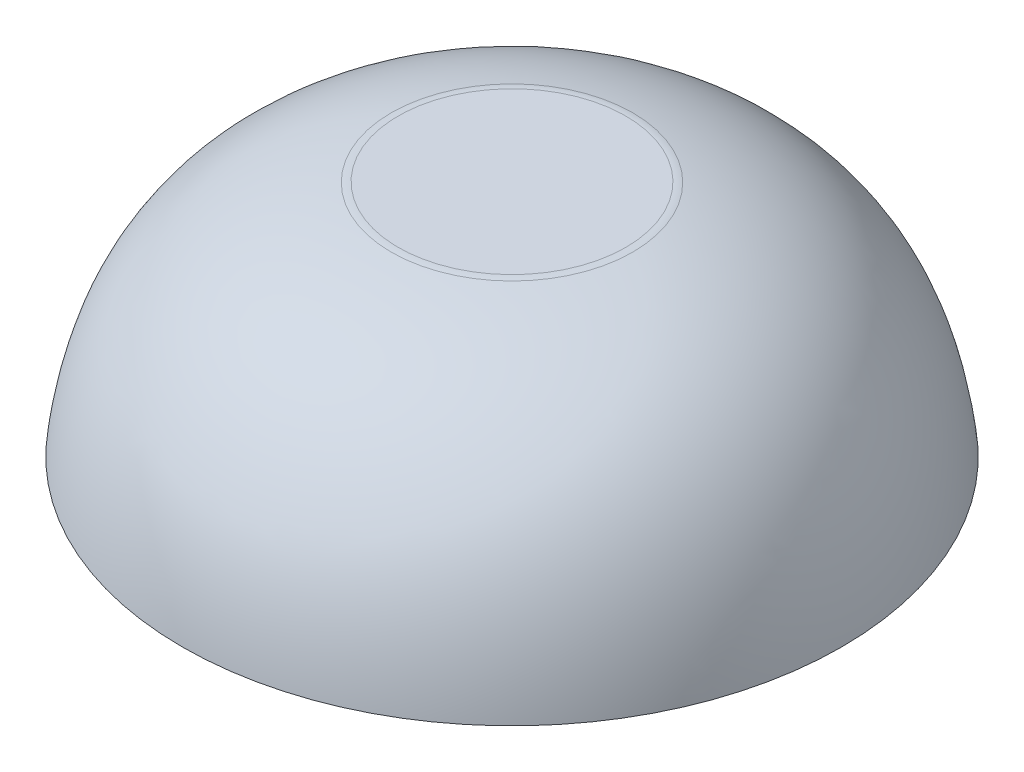
ISO-10303-21;
HEADER;
FILE_DESCRIPTION(('STEP AP214'),'2;1');
FILE_NAME('part.step','',(''),(''),'','','');
FILE_SCHEMA(('AUTOMOTIVE_DESIGN { 1 0 10303 214 1 1 1 1 }'));
ENDSEC;
DATA;
#1=APPLICATION_CONTEXT('core data for automotive mechanical design processes');
#2=APPLICATION_PROTOCOL_DEFINITION('international standard','automotive_design',2000,#1);
#3=PRODUCT_CONTEXT('',#1,'mechanical');
#4=PRODUCT('Part','Part','',(#3));
#5=PRODUCT_RELATED_PRODUCT_CATEGORY('part','',(#4));
#6=PRODUCT_DEFINITION_FORMATION('','',#4);
#7=PRODUCT_DEFINITION_CONTEXT('part definition',#1,'design');
#8=PRODUCT_DEFINITION('design','',#6,#7);
#9=PRODUCT_DEFINITION_SHAPE('','',#8);
#10=(LENGTH_UNIT() NAMED_UNIT(*) SI_UNIT(.MILLI.,.METRE.));
#11=(NAMED_UNIT(*) PLANE_ANGLE_UNIT() SI_UNIT($,.RADIAN.));
#12=(NAMED_UNIT(*) SI_UNIT($,.STERADIAN.) SOLID_ANGLE_UNIT());
#13=UNCERTAINTY_MEASURE_WITH_UNIT(LENGTH_MEASURE(1.E-05),#10,'distance_accuracy_value','');
#14=(GEOMETRIC_REPRESENTATION_CONTEXT(3) GLOBAL_UNCERTAINTY_ASSIGNED_CONTEXT((#13)) GLOBAL_UNIT_ASSIGNED_CONTEXT((#10,
#11,#12)) REPRESENTATION_CONTEXT('',''));
#15=CARTESIAN_POINT('',(0.,0.,0.));
#16=DIRECTION('',(0.,0.,1.));
#17=DIRECTION('',(1.,0.,0.));
#18=AXIS2_PLACEMENT_3D('',#15,#16,#17);
#19=CARTESIAN_POINT('',(-0.9,0.,0.));
#20=DIRECTION('',(0.,1.,0.));
#21=DIRECTION('',(-1.,0.,0.));
#22=AXIS2_PLACEMENT_3D('',#19,#20,#21);
#23=PLANE('',#22);
#24=CARTESIAN_POINT('',(0.,0.,0.));
#25=DIRECTION('',(0.,-1.,0.));
#26=DIRECTION('',(1.,0.,0.));
#27=AXIS2_PLACEMENT_3D('',#24,#25,#26);
#28=CIRCLE('',#27,0.9);
#29=CARTESIAN_POINT('',(0.9,0.,0.));
#30=VERTEX_POINT('',#29);
#31=EDGE_CURVE('E26',#30,#30,#28,.T.);
#32=ORIENTED_EDGE('',*,*,#31,.T.);
#33=EDGE_LOOP('',(#32));
#34=FACE_BOUND('',#33,.T.);
#35=ADVANCED_FACE('F15',(#34),#23,.F.);
#36=CARTESIAN_POINT('',(-0.32,0.65,0.));
#37=CARTESIAN_POINT('',(-0.837297425109172,0.555696946829337,0.));
#38=CARTESIAN_POINT('',(-0.9,0.,0.));
#39=B_SPLINE_CURVE_WITH_KNOTS('',2,(#36,#37,#38),.UNSPECIFIED.,.F.,.F.,(3,3),(0.,1.),.UNSPECIFIED.);
#40=CARTESIAN_POINT('',(0.,0.,0.));
#41=DIRECTION('',(0.,-1.,0.));
#42=AXIS1_PLACEMENT('',#40,#41);
#43=SURFACE_OF_REVOLUTION('',#39,#42);
#44=CARTESIAN_POINT('',(0.,0.648202934982108,0.));
#45=DIRECTION('',(0.,-1.,0.));
#46=DIRECTION('',(1.,0.,0.));
#47=AXIS2_PLACEMENT_3D('',#44,#45,#46);
#48=CIRCLE('',#47,0.329598661351431);
#49=CARTESIAN_POINT('',(0.329598661351431,0.648202934982108,0.));
#50=VERTEX_POINT('',#49);
#51=EDGE_CURVE('E22',#50,#50,#48,.T.);
#52=ORIENTED_EDGE('',*,*,#51,.T.);
#53=EDGE_LOOP('',(#52));
#54=FACE_BOUND('',#53,.T.);
#55=ORIENTED_EDGE('',*,*,#31,.F.);
#56=EDGE_LOOP('',(#55));
#57=FACE_BOUND('',#56,.T.);
#58=ADVANCED_FACE('F39',(#54,#57),#43,.T.);
#59=CARTESIAN_POINT('',(0.,0.65,0.));
#60=DIRECTION('',(0.,-1.,0.));
#61=DIRECTION('',(1.,0.,0.));
#62=AXIS2_PLACEMENT_3D('',#59,#60,#61);
#63=PLANE('',#62);
#64=CARTESIAN_POINT('',(0.,0.65,0.));
#65=DIRECTION('',(0.,-1.,0.));
#66=DIRECTION('',(1.,0.,0.));
#67=AXIS2_PLACEMENT_3D('',#64,#65,#66);
#68=CIRCLE('',#67,0.310725835360085);
#69=CARTESIAN_POINT('',(0.310725835360085,0.65,0.));
#70=VERTEX_POINT('',#69);
#71=EDGE_CURVE('E10',#70,#70,#68,.F.);
#72=ORIENTED_EDGE('',*,*,#71,.T.);
#73=EDGE_LOOP('',(#72));
#74=FACE_BOUND('',#73,.T.);
#75=ADVANCED_FACE('F42',(#74),#63,.F.);
#76=CARTESIAN_POINT('',(0.,0.55,0.));
#77=DIRECTION('',(0.,-1.,0.));
#78=DIRECTION('',(1.,0.,0.));
#79=AXIS2_PLACEMENT_3D('',#76,#77,#78);
#80=TOROIDAL_SURFACE('',#79,0.310725835360085,0.1);
#81=ORIENTED_EDGE('',*,*,#71,.F.);
#82=EDGE_LOOP('',(#81));
#83=FACE_BOUND('',#82,.T.);
#84=ORIENTED_EDGE('',*,*,#51,.F.);
#85=EDGE_LOOP('',(#84));
#86=FACE_BOUND('',#85,.T.);
#87=ADVANCED_FACE('F17',(#83,#86),#80,.T.);
#88=CLOSED_SHELL('',(#35,#58,#75,#87));
#89=MANIFOLD_SOLID_BREP('B1',#88);
#90=ADVANCED_BREP_SHAPE_REPRESENTATION('',(#18,#89),#14);
#91=SHAPE_DEFINITION_REPRESENTATION(#9,#90);
ENDSEC;
END-ISO-10303-21;
